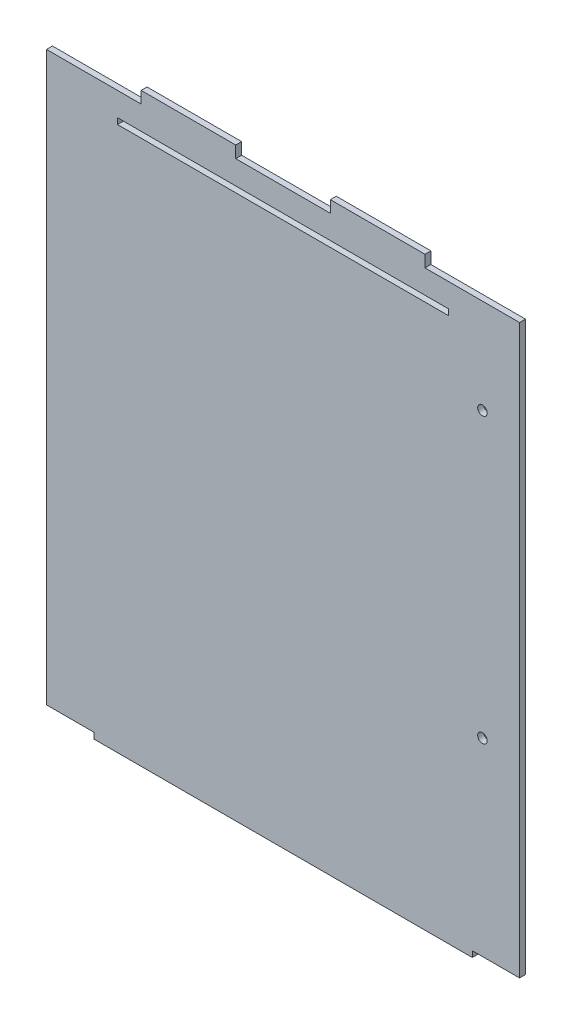
ISO-10303-21;
HEADER;
FILE_DESCRIPTION(('STEP AP214'),'2;1');
FILE_NAME('part.step','',(''),(''),'','','');
FILE_SCHEMA(('AUTOMOTIVE_DESIGN { 1 0 10303 214 1 1 1 1 }'));
ENDSEC;
DATA;
#1=APPLICATION_CONTEXT('core data for automotive mechanical design processes');
#2=APPLICATION_PROTOCOL_DEFINITION('international standard','automotive_design',2000,#1);
#3=PRODUCT_CONTEXT('',#1,'mechanical');
#4=PRODUCT('Part','Part','',(#3));
#5=PRODUCT_RELATED_PRODUCT_CATEGORY('part','',(#4));
#6=PRODUCT_DEFINITION_FORMATION('','',#4);
#7=PRODUCT_DEFINITION_CONTEXT('part definition',#1,'design');
#8=PRODUCT_DEFINITION('design','',#6,#7);
#9=PRODUCT_DEFINITION_SHAPE('','',#8);
#10=(LENGTH_UNIT() NAMED_UNIT(*) SI_UNIT(.MILLI.,.METRE.));
#11=(NAMED_UNIT(*) PLANE_ANGLE_UNIT() SI_UNIT($,.RADIAN.));
#12=(NAMED_UNIT(*) SI_UNIT($,.STERADIAN.) SOLID_ANGLE_UNIT());
#13=UNCERTAINTY_MEASURE_WITH_UNIT(LENGTH_MEASURE(1.E-05),#10,'distance_accuracy_value','');
#14=(GEOMETRIC_REPRESENTATION_CONTEXT(3) GLOBAL_UNCERTAINTY_ASSIGNED_CONTEXT((#13)) GLOBAL_UNIT_ASSIGNED_CONTEXT((#10,
#11,#12)) REPRESENTATION_CONTEXT('',''));
#15=CARTESIAN_POINT('',(0.,0.,0.));
#16=DIRECTION('',(0.,0.,1.));
#17=DIRECTION('',(1.,0.,0.));
#18=AXIS2_PLACEMENT_3D('',#15,#16,#17);
#19=CARTESIAN_POINT('',(0.,288.925,3.175));
#20=DIRECTION('',(0.,1.,0.));
#21=DIRECTION('',(-1.,0.,0.));
#22=AXIS2_PLACEMENT_3D('',#19,#20,#21);
#23=PLANE('',#22);
#24=DIRECTION('',(1.,0.,0.));
#25=VECTOR('',#24,1.);
#26=CARTESIAN_POINT('',(0.,288.925,0.));
#27=LINE('',#26,#25);
#28=CARTESIAN_POINT('',(38.1,288.925,0.));
#29=VERTEX_POINT('',#28);
#30=CARTESIAN_POINT('',(215.9,288.925,0.));
#31=VERTEX_POINT('',#30);
#32=EDGE_CURVE('E249',#29,#31,#27,.T.);
#33=ORIENTED_EDGE('',*,*,#32,.T.);
#34=DIRECTION('',(0.,0.,-1.));
#35=VECTOR('',#34,1.);
#36=CARTESIAN_POINT('',(215.9,288.925,3.175));
#37=LINE('',#36,#35);
#38=CARTESIAN_POINT('',(215.9,288.925,3.175));
#39=VERTEX_POINT('',#38);
#40=EDGE_CURVE('E11',#39,#31,#37,.T.);
#41=ORIENTED_EDGE('',*,*,#40,.F.);
#42=DIRECTION('',(1.,0.,0.));
#43=VECTOR('',#42,1.);
#44=CARTESIAN_POINT('',(0.,288.925,3.175));
#45=LINE('',#44,#43);
#46=CARTESIAN_POINT('',(38.1,288.925,3.175));
#47=VERTEX_POINT('',#46);
#48=EDGE_CURVE('E187',#47,#39,#45,.T.);
#49=ORIENTED_EDGE('',*,*,#48,.F.);
#50=DIRECTION('',(0.,0.,-1.));
#51=VECTOR('',#50,1.);
#52=CARTESIAN_POINT('',(38.1,288.925,3.175));
#53=LINE('',#52,#51);
#54=EDGE_CURVE('E54',#47,#29,#53,.T.);
#55=ORIENTED_EDGE('',*,*,#54,.T.);
#56=EDGE_LOOP('',(#33,#41,#49,#55));
#57=FACE_BOUND('',#56,.T.);
#58=ADVANCED_FACE('F35',(#57),#23,.F.);
#59=CARTESIAN_POINT('',(215.9,0.,3.175));
#60=DIRECTION('',(1.,0.,0.));
#61=DIRECTION('',(0.,0.,-1.));
#62=AXIS2_PLACEMENT_3D('',#59,#60,#61);
#63=PLANE('',#62);
#64=DIRECTION('',(0.,-1.,0.));
#65=VECTOR('',#64,1.);
#66=CARTESIAN_POINT('',(215.9,0.,0.));
#67=LINE('',#66,#65);
#68=CARTESIAN_POINT('',(215.9,285.75,0.));
#69=VERTEX_POINT('',#68);
#70=EDGE_CURVE('E193',#31,#69,#67,.T.);
#71=ORIENTED_EDGE('',*,*,#70,.T.);
#72=DIRECTION('',(0.,0.,-1.));
#73=VECTOR('',#72,1.);
#74=CARTESIAN_POINT('',(215.9,285.75,3.175));
#75=LINE('',#74,#73);
#76=CARTESIAN_POINT('',(215.9,285.75,3.175));
#77=VERTEX_POINT('',#76);
#78=EDGE_CURVE('E45',#77,#69,#75,.T.);
#79=ORIENTED_EDGE('',*,*,#78,.F.);
#80=DIRECTION('',(0.,-1.,0.));
#81=VECTOR('',#80,1.);
#82=CARTESIAN_POINT('',(215.9,0.,3.175));
#83=LINE('',#82,#81);
#84=EDGE_CURVE('E181',#39,#77,#83,.T.);
#85=ORIENTED_EDGE('',*,*,#84,.F.);
#86=ORIENTED_EDGE('',*,*,#40,.T.);
#87=EDGE_LOOP('',(#71,#79,#85,#86));
#88=FACE_BOUND('',#87,.T.);
#89=ADVANCED_FACE('F192',(#88),#63,.F.);
#90=CARTESIAN_POINT('',(0.,285.75,3.175));
#91=DIRECTION('',(0.,1.,0.));
#92=DIRECTION('',(0.,0.,1.));
#93=AXIS2_PLACEMENT_3D('',#90,#91,#92);
#94=PLANE('',#93);
#95=DIRECTION('',(1.,0.,0.));
#96=VECTOR('',#95,1.);
#97=CARTESIAN_POINT('',(0.,285.75,0.));
#98=LINE('',#97,#96);
#99=CARTESIAN_POINT('',(38.1,285.75,0.));
#100=VERTEX_POINT('',#99);
#101=EDGE_CURVE('E252',#100,#69,#98,.T.);
#102=ORIENTED_EDGE('',*,*,#101,.F.);
#103=DIRECTION('',(0.,0.,-1.));
#104=VECTOR('',#103,1.);
#105=CARTESIAN_POINT('',(38.1,285.75,3.175));
#106=LINE('',#105,#104);
#107=CARTESIAN_POINT('',(38.1,285.75,3.175));
#108=VERTEX_POINT('',#107);
#109=EDGE_CURVE('E116',#108,#100,#106,.T.);
#110=ORIENTED_EDGE('',*,*,#109,.F.);
#111=DIRECTION('',(1.,0.,0.));
#112=VECTOR('',#111,1.);
#113=CARTESIAN_POINT('',(0.,285.75,3.175));
#114=LINE('',#113,#112);
#115=EDGE_CURVE('E186',#108,#77,#114,.T.);
#116=ORIENTED_EDGE('',*,*,#115,.T.);
#117=ORIENTED_EDGE('',*,*,#78,.T.);
#118=EDGE_LOOP('',(#102,#110,#116,#117));
#119=FACE_BOUND('',#118,.T.);
#120=ADVANCED_FACE('F197',(#119),#94,.T.);
#121=CARTESIAN_POINT('',(228.6,0.,3.175));
#122=DIRECTION('',(-1.,0.,0.));
#123=DIRECTION('',(0.,0.,1.));
#124=AXIS2_PLACEMENT_3D('',#121,#122,#123);
#125=PLANE('',#124);
#126=DIRECTION('',(0.,1.,0.));
#127=VECTOR('',#126,1.);
#128=CARTESIAN_POINT('',(228.6,0.,0.));
#129=LINE('',#128,#127);
#130=CARTESIAN_POINT('',(228.6,-6.34999999999996,0.));
#131=VERTEX_POINT('',#130);
#132=CARTESIAN_POINT('',(228.6,-3.17499999999996,0.));
#133=VERTEX_POINT('',#132);
#134=EDGE_CURVE('E204',#131,#133,#129,.T.);
#135=ORIENTED_EDGE('',*,*,#134,.T.);
#136=DIRECTION('',(0.,0.,-1.));
#137=VECTOR('',#136,1.);
#138=CARTESIAN_POINT('',(228.6,-3.17499999999996,3.175));
#139=LINE('',#138,#137);
#140=CARTESIAN_POINT('',(228.6,-3.17499999999996,3.175));
#141=VERTEX_POINT('',#140);
#142=EDGE_CURVE('E39',#141,#133,#139,.T.);
#143=ORIENTED_EDGE('',*,*,#142,.F.);
#144=DIRECTION('',(0.,1.,0.));
#145=VECTOR('',#144,1.);
#146=CARTESIAN_POINT('',(228.6,0.,3.175));
#147=LINE('',#146,#145);
#148=CARTESIAN_POINT('',(228.6,-6.34999999999996,3.175));
#149=VERTEX_POINT('',#148);
#150=EDGE_CURVE('E257',#149,#141,#147,.T.);
#151=ORIENTED_EDGE('',*,*,#150,.F.);
#152=DIRECTION('',(0.,0.,-1.));
#153=VECTOR('',#152,1.);
#154=CARTESIAN_POINT('',(228.6,-6.34999999999996,3.175));
#155=LINE('',#154,#153);
#156=EDGE_CURVE('E200',#149,#131,#155,.T.);
#157=ORIENTED_EDGE('',*,*,#156,.T.);
#158=EDGE_LOOP('',(#135,#143,#151,#157));
#159=FACE_BOUND('',#158,.T.);
#160=ADVANCED_FACE('F37',(#159),#125,.F.);
#161=CARTESIAN_POINT('',(0.,-3.17499999999997,3.175));
#162=DIRECTION('',(0.,1.,0.));
#163=DIRECTION('',(-1.,0.,0.));
#164=AXIS2_PLACEMENT_3D('',#161,#162,#163);
#165=PLANE('',#164);
#166=DIRECTION('',(1.,0.,0.));
#167=VECTOR('',#166,1.);
#168=CARTESIAN_POINT('',(0.,-3.17499999999997,0.));
#169=LINE('',#168,#167);
#170=CARTESIAN_POINT('',(254.,-3.17499999999995,0.));
#171=VERTEX_POINT('',#170);
#172=EDGE_CURVE('E207',#133,#171,#169,.T.);
#173=ORIENTED_EDGE('',*,*,#172,.T.);
#174=DIRECTION('',(0.,0.,-1.));
#175=VECTOR('',#174,1.);
#176=CARTESIAN_POINT('',(254.,-3.17499999999995,3.175));
#177=LINE('',#176,#175);
#178=CARTESIAN_POINT('',(254.,-3.17499999999995,3.175));
#179=VERTEX_POINT('',#178);
#180=EDGE_CURVE('E289',#179,#171,#177,.T.);
#181=ORIENTED_EDGE('',*,*,#180,.F.);
#182=DIRECTION('',(1.,0.,0.));
#183=VECTOR('',#182,1.);
#184=CARTESIAN_POINT('',(0.,-3.17499999999997,3.175));
#185=LINE('',#184,#183);
#186=EDGE_CURVE('E129',#141,#179,#185,.T.);
#187=ORIENTED_EDGE('',*,*,#186,.F.);
#188=ORIENTED_EDGE('',*,*,#142,.T.);
#189=EDGE_LOOP('',(#173,#181,#187,#188));
#190=FACE_BOUND('',#189,.T.);
#191=ADVANCED_FACE('F295',(#190),#165,.F.);
#192=CARTESIAN_POINT('',(254.,0.,3.175));
#193=DIRECTION('',(-1.,0.,0.));
#194=DIRECTION('',(0.,0.,1.));
#195=AXIS2_PLACEMENT_3D('',#192,#193,#194);
#196=PLANE('',#195);
#197=DIRECTION('',(0.,1.,0.));
#198=VECTOR('',#197,1.);
#199=CARTESIAN_POINT('',(254.,0.,0.));
#200=LINE('',#199,#198);
#201=CARTESIAN_POINT('',(254.,301.625,0.));
#202=VERTEX_POINT('',#201);
#203=EDGE_CURVE('E210',#171,#202,#200,.T.);
#204=ORIENTED_EDGE('',*,*,#203,.T.);
#205=DIRECTION('',(0.,0.,-1.));
#206=VECTOR('',#205,1.);
#207=CARTESIAN_POINT('',(254.,301.625,3.175));
#208=LINE('',#207,#206);
#209=CARTESIAN_POINT('',(254.,301.625,3.175));
#210=VERTEX_POINT('',#209);
#211=EDGE_CURVE('E288',#210,#202,#208,.T.);
#212=ORIENTED_EDGE('',*,*,#211,.F.);
#213=DIRECTION('',(0.,1.,0.));
#214=VECTOR('',#213,1.);
#215=CARTESIAN_POINT('',(254.,0.,3.175));
#216=LINE('',#215,#214);
#217=EDGE_CURVE('E309',#179,#210,#216,.T.);
#218=ORIENTED_EDGE('',*,*,#217,.F.);
#219=ORIENTED_EDGE('',*,*,#180,.T.);
#220=EDGE_LOOP('',(#204,#212,#218,#219));
#221=FACE_BOUND('',#220,.T.);
#222=ADVANCED_FACE('F307',(#221),#196,.F.);
#223=CARTESIAN_POINT('',(0.,301.625,3.175));
#224=DIRECTION('',(0.,1.,0.));
#225=DIRECTION('',(0.,0.,1.));
#226=AXIS2_PLACEMENT_3D('',#223,#224,#225);
#227=PLANE('',#226);
#228=DIRECTION('',(1.,0.,0.));
#229=VECTOR('',#228,1.);
#230=CARTESIAN_POINT('',(0.,301.625,0.));
#231=LINE('',#230,#229);
#232=CARTESIAN_POINT('',(203.2,301.625,0.));
#233=VERTEX_POINT('',#232);
#234=EDGE_CURVE('E213',#233,#202,#231,.T.);
#235=ORIENTED_EDGE('',*,*,#234,.F.);
#236=DIRECTION('',(0.,0.,-1.));
#237=VECTOR('',#236,1.);
#238=CARTESIAN_POINT('',(203.2,301.625,3.175));
#239=LINE('',#238,#237);
#240=CARTESIAN_POINT('',(203.2,301.625,3.175));
#241=VERTEX_POINT('',#240);
#242=EDGE_CURVE('E286',#241,#233,#239,.T.);
#243=ORIENTED_EDGE('',*,*,#242,.F.);
#244=DIRECTION('',(1.,0.,0.));
#245=VECTOR('',#244,1.);
#246=CARTESIAN_POINT('',(0.,301.625,3.175));
#247=LINE('',#246,#245);
#248=EDGE_CURVE('E312',#241,#210,#247,.T.);
#249=ORIENTED_EDGE('',*,*,#248,.T.);
#250=ORIENTED_EDGE('',*,*,#211,.T.);
#251=EDGE_LOOP('',(#235,#243,#249,#250));
#252=FACE_BOUND('',#251,.T.);
#253=ADVANCED_FACE('F313',(#252),#227,.T.);
#254=CARTESIAN_POINT('',(203.2,0.,3.175));
#255=DIRECTION('',(1.,0.,0.));
#256=DIRECTION('',(0.,0.,-1.));
#257=AXIS2_PLACEMENT_3D('',#254,#255,#256);
#258=PLANE('',#257);
#259=DIRECTION('',(0.,-1.,0.));
#260=VECTOR('',#259,1.);
#261=CARTESIAN_POINT('',(203.2,0.,0.));
#262=LINE('',#261,#260);
#263=CARTESIAN_POINT('',(203.2,307.975,0.));
#264=VERTEX_POINT('',#263);
#265=EDGE_CURVE('E216',#264,#233,#262,.T.);
#266=ORIENTED_EDGE('',*,*,#265,.F.);
#267=DIRECTION('',(0.,0.,-1.));
#268=VECTOR('',#267,1.);
#269=CARTESIAN_POINT('',(203.2,307.975,3.175));
#270=LINE('',#269,#268);
#271=CARTESIAN_POINT('',(203.2,307.975,3.175));
#272=VERTEX_POINT('',#271);
#273=EDGE_CURVE('E284',#272,#264,#270,.T.);
#274=ORIENTED_EDGE('',*,*,#273,.F.);
#275=DIRECTION('',(0.,-1.,0.));
#276=VECTOR('',#275,1.);
#277=CARTESIAN_POINT('',(203.2,0.,3.175));
#278=LINE('',#277,#276);
#279=EDGE_CURVE('E317',#272,#241,#278,.T.);
#280=ORIENTED_EDGE('',*,*,#279,.T.);
#281=ORIENTED_EDGE('',*,*,#242,.T.);
#282=EDGE_LOOP('',(#266,#274,#280,#281));
#283=FACE_BOUND('',#282,.T.);
#284=ADVANCED_FACE('F442',(#283),#258,.T.);
#285=CARTESIAN_POINT('',(0.,307.975,3.175));
#286=DIRECTION('',(0.,1.,0.));
#287=DIRECTION('',(0.,0.,1.));
#288=AXIS2_PLACEMENT_3D('',#285,#286,#287);
#289=PLANE('',#288);
#290=DIRECTION('',(1.,0.,0.));
#291=VECTOR('',#290,1.);
#292=CARTESIAN_POINT('',(0.,307.975,0.));
#293=LINE('',#292,#291);
#294=CARTESIAN_POINT('',(152.4,307.975,0.));
#295=VERTEX_POINT('',#294);
#296=EDGE_CURVE('E219',#295,#264,#293,.T.);
#297=ORIENTED_EDGE('',*,*,#296,.F.);
#298=DIRECTION('',(0.,0.,-1.));
#299=VECTOR('',#298,1.);
#300=CARTESIAN_POINT('',(152.4,307.975,3.175));
#301=LINE('',#300,#299);
#302=CARTESIAN_POINT('',(152.4,307.975,3.175));
#303=VERTEX_POINT('',#302);
#304=EDGE_CURVE('E282',#303,#295,#301,.T.);
#305=ORIENTED_EDGE('',*,*,#304,.F.);
#306=DIRECTION('',(1.,0.,0.));
#307=VECTOR('',#306,1.);
#308=CARTESIAN_POINT('',(0.,307.975,3.175));
#309=LINE('',#308,#307);
#310=EDGE_CURVE('E319',#303,#272,#309,.T.);
#311=ORIENTED_EDGE('',*,*,#310,.T.);
#312=ORIENTED_EDGE('',*,*,#273,.T.);
#313=EDGE_LOOP('',(#297,#305,#311,#312));
#314=FACE_BOUND('',#313,.T.);
#315=ADVANCED_FACE('F438',(#314),#289,.T.);
#316=CARTESIAN_POINT('',(152.4,0.,3.175));
#317=DIRECTION('',(-1.,0.,0.));
#318=DIRECTION('',(0.,0.,1.));
#319=AXIS2_PLACEMENT_3D('',#316,#317,#318);
#320=PLANE('',#319);
#321=DIRECTION('',(0.,1.,0.));
#322=VECTOR('',#321,1.);
#323=CARTESIAN_POINT('',(152.4,0.,0.));
#324=LINE('',#323,#322);
#325=CARTESIAN_POINT('',(152.4,301.625,0.));
#326=VERTEX_POINT('',#325);
#327=EDGE_CURVE('E222',#326,#295,#324,.T.);
#328=ORIENTED_EDGE('',*,*,#327,.F.);
#329=DIRECTION('',(0.,0.,-1.));
#330=VECTOR('',#329,1.);
#331=CARTESIAN_POINT('',(152.4,301.625,3.175));
#332=LINE('',#331,#330);
#333=CARTESIAN_POINT('',(152.4,301.625,3.175));
#334=VERTEX_POINT('',#333);
#335=EDGE_CURVE('E280',#334,#326,#332,.T.);
#336=ORIENTED_EDGE('',*,*,#335,.F.);
#337=DIRECTION('',(0.,1.,0.));
#338=VECTOR('',#337,1.);
#339=CARTESIAN_POINT('',(152.4,0.,3.175));
#340=LINE('',#339,#338);
#341=EDGE_CURVE('E326',#334,#303,#340,.T.);
#342=ORIENTED_EDGE('',*,*,#341,.T.);
#343=ORIENTED_EDGE('',*,*,#304,.T.);
#344=EDGE_LOOP('',(#328,#336,#342,#343));
#345=FACE_BOUND('',#344,.T.);
#346=ADVANCED_FACE('F434',(#345),#320,.T.);
#347=CARTESIAN_POINT('',(0.,301.625,3.175));
#348=DIRECTION('',(0.,1.,0.));
#349=DIRECTION('',(0.,0.,1.));
#350=AXIS2_PLACEMENT_3D('',#347,#348,#349);
#351=PLANE('',#350);
#352=DIRECTION('',(1.,0.,0.));
#353=VECTOR('',#352,1.);
#354=CARTESIAN_POINT('',(0.,301.625,0.));
#355=LINE('',#354,#353);
#356=CARTESIAN_POINT('',(101.6,301.625,0.));
#357=VERTEX_POINT('',#356);
#358=EDGE_CURVE('E225',#357,#326,#355,.T.);
#359=ORIENTED_EDGE('',*,*,#358,.F.);
#360=DIRECTION('',(0.,0.,-1.));
#361=VECTOR('',#360,1.);
#362=CARTESIAN_POINT('',(101.6,301.625,3.175));
#363=LINE('',#362,#361);
#364=CARTESIAN_POINT('',(101.6,301.625,3.175));
#365=VERTEX_POINT('',#364);
#366=EDGE_CURVE('E278',#365,#357,#363,.T.);
#367=ORIENTED_EDGE('',*,*,#366,.F.);
#368=DIRECTION('',(1.,0.,0.));
#369=VECTOR('',#368,1.);
#370=CARTESIAN_POINT('',(0.,301.625,3.175));
#371=LINE('',#370,#369);
#372=EDGE_CURVE('E329',#365,#334,#371,.T.);
#373=ORIENTED_EDGE('',*,*,#372,.T.);
#374=ORIENTED_EDGE('',*,*,#335,.T.);
#375=EDGE_LOOP('',(#359,#367,#373,#374));
#376=FACE_BOUND('',#375,.T.);
#377=ADVANCED_FACE('F430',(#376),#351,.T.);
#378=CARTESIAN_POINT('',(101.600000000001,2.22044604925032E-13,3.175));
#379=DIRECTION('',(1.,0.,0.));
#380=DIRECTION('',(0.,1.,0.));
#381=AXIS2_PLACEMENT_3D('',#378,#379,#380);
#382=PLANE('',#381);
#383=DIRECTION('',(0.,-1.,0.));
#384=VECTOR('',#383,1.);
#385=CARTESIAN_POINT('',(101.600000000001,2.22044604925032E-13,0.));
#386=LINE('',#385,#384);
#387=CARTESIAN_POINT('',(101.6,307.975,0.));
#388=VERTEX_POINT('',#387);
#389=EDGE_CURVE('E228',#388,#357,#386,.T.);
#390=ORIENTED_EDGE('',*,*,#389,.F.);
#391=DIRECTION('',(0.,0.,-1.));
#392=VECTOR('',#391,1.);
#393=CARTESIAN_POINT('',(101.6,307.975,3.175));
#394=LINE('',#393,#392);
#395=CARTESIAN_POINT('',(101.6,307.975,3.175));
#396=VERTEX_POINT('',#395);
#397=EDGE_CURVE('E276',#396,#388,#394,.T.);
#398=ORIENTED_EDGE('',*,*,#397,.F.);
#399=DIRECTION('',(0.,-1.,0.));
#400=VECTOR('',#399,1.);
#401=CARTESIAN_POINT('',(101.600000000001,2.22044604925032E-13,3.175));
#402=LINE('',#401,#400);
#403=EDGE_CURVE('E332',#396,#365,#402,.T.);
#404=ORIENTED_EDGE('',*,*,#403,.T.);
#405=ORIENTED_EDGE('',*,*,#366,.T.);
#406=EDGE_LOOP('',(#390,#398,#404,#405));
#407=FACE_BOUND('',#406,.T.);
#408=ADVANCED_FACE('F426',(#407),#382,.T.);
#409=CARTESIAN_POINT('',(0.,307.975,3.175));
#410=DIRECTION('',(0.,1.,0.));
#411=DIRECTION('',(0.,0.,1.));
#412=AXIS2_PLACEMENT_3D('',#409,#410,#411);
#413=PLANE('',#412);
#414=DIRECTION('',(1.,0.,0.));
#415=VECTOR('',#414,1.);
#416=CARTESIAN_POINT('',(0.,307.975,0.));
#417=LINE('',#416,#415);
#418=CARTESIAN_POINT('',(50.8,307.975,0.));
#419=VERTEX_POINT('',#418);
#420=EDGE_CURVE('E231',#419,#388,#417,.T.);
#421=ORIENTED_EDGE('',*,*,#420,.F.);
#422=DIRECTION('',(0.,0.,-1.));
#423=VECTOR('',#422,1.);
#424=CARTESIAN_POINT('',(50.8,307.975,3.175));
#425=LINE('',#424,#423);
#426=CARTESIAN_POINT('',(50.8,307.975,3.175));
#427=VERTEX_POINT('',#426);
#428=EDGE_CURVE('E274',#427,#419,#425,.T.);
#429=ORIENTED_EDGE('',*,*,#428,.F.);
#430=DIRECTION('',(1.,0.,0.));
#431=VECTOR('',#430,1.);
#432=CARTESIAN_POINT('',(0.,307.975,3.175));
#433=LINE('',#432,#431);
#434=EDGE_CURVE('E335',#427,#396,#433,.T.);
#435=ORIENTED_EDGE('',*,*,#434,.T.);
#436=ORIENTED_EDGE('',*,*,#397,.T.);
#437=EDGE_LOOP('',(#421,#429,#435,#436));
#438=FACE_BOUND('',#437,.T.);
#439=ADVANCED_FACE('F422',(#438),#413,.T.);
#440=CARTESIAN_POINT('',(50.8,0.,3.175));
#441=DIRECTION('',(-1.,0.,0.));
#442=DIRECTION('',(0.,0.,1.));
#443=AXIS2_PLACEMENT_3D('',#440,#441,#442);
#444=PLANE('',#443);
#445=DIRECTION('',(0.,1.,0.));
#446=VECTOR('',#445,1.);
#447=CARTESIAN_POINT('',(50.8,0.,0.));
#448=LINE('',#447,#446);
#449=CARTESIAN_POINT('',(50.8,301.625,0.));
#450=VERTEX_POINT('',#449);
#451=EDGE_CURVE('E234',#450,#419,#448,.T.);
#452=ORIENTED_EDGE('',*,*,#451,.F.);
#453=DIRECTION('',(0.,0.,-1.));
#454=VECTOR('',#453,1.);
#455=CARTESIAN_POINT('',(50.8,301.625,3.175));
#456=LINE('',#455,#454);
#457=CARTESIAN_POINT('',(50.8,301.625,3.175));
#458=VERTEX_POINT('',#457);
#459=EDGE_CURVE('E272',#458,#450,#456,.T.);
#460=ORIENTED_EDGE('',*,*,#459,.F.);
#461=DIRECTION('',(0.,1.,0.));
#462=VECTOR('',#461,1.);
#463=CARTESIAN_POINT('',(50.8,0.,3.175));
#464=LINE('',#463,#462);
#465=EDGE_CURVE('E338',#458,#427,#464,.T.);
#466=ORIENTED_EDGE('',*,*,#465,.T.);
#467=ORIENTED_EDGE('',*,*,#428,.T.);
#468=EDGE_LOOP('',(#452,#460,#466,#467));
#469=FACE_BOUND('',#468,.T.);
#470=ADVANCED_FACE('F418',(#469),#444,.T.);
#471=CARTESIAN_POINT('',(0.,301.625,3.175));
#472=DIRECTION('',(0.,1.,0.));
#473=DIRECTION('',(0.,0.,1.));
#474=AXIS2_PLACEMENT_3D('',#471,#472,#473);
#475=PLANE('',#474);
#476=DIRECTION('',(1.,0.,0.));
#477=VECTOR('',#476,1.);
#478=CARTESIAN_POINT('',(0.,301.625,0.));
#479=LINE('',#478,#477);
#480=CARTESIAN_POINT('',(0.,301.625,0.));
#481=VERTEX_POINT('',#480);
#482=EDGE_CURVE('E237',#481,#450,#479,.T.);
#483=ORIENTED_EDGE('',*,*,#482,.F.);
#484=DIRECTION('',(0.,0.,-1.));
#485=VECTOR('',#484,1.);
#486=CARTESIAN_POINT('',(0.,301.625,3.175));
#487=LINE('',#486,#485);
#488=CARTESIAN_POINT('',(0.,301.625,3.175));
#489=VERTEX_POINT('',#488);
#490=EDGE_CURVE('E270',#489,#481,#487,.T.);
#491=ORIENTED_EDGE('',*,*,#490,.F.);
#492=DIRECTION('',(1.,0.,0.));
#493=VECTOR('',#492,1.);
#494=CARTESIAN_POINT('',(0.,301.625,3.175));
#495=LINE('',#494,#493);
#496=EDGE_CURVE('E341',#489,#458,#495,.T.);
#497=ORIENTED_EDGE('',*,*,#496,.T.);
#498=ORIENTED_EDGE('',*,*,#459,.T.);
#499=EDGE_LOOP('',(#483,#491,#497,#498));
#500=FACE_BOUND('',#499,.T.);
#501=ADVANCED_FACE('F414',(#500),#475,.T.);
#502=CARTESIAN_POINT('',(0.,0.,3.175));
#503=DIRECTION('',(-1.,0.,0.));
#504=DIRECTION('',(0.,-1.,0.));
#505=AXIS2_PLACEMENT_3D('',#502,#503,#504);
#506=PLANE('',#505);
#507=DIRECTION('',(0.,1.,0.));
#508=VECTOR('',#507,1.);
#509=CARTESIAN_POINT('',(0.,0.,0.));
#510=LINE('',#509,#508);
#511=CARTESIAN_POINT('',(0.,-3.17499999999997,0.));
#512=VERTEX_POINT('',#511);
#513=EDGE_CURVE('E240',#512,#481,#510,.T.);
#514=ORIENTED_EDGE('',*,*,#513,.F.);
#515=DIRECTION('',(0.,0.,-1.));
#516=VECTOR('',#515,1.);
#517=CARTESIAN_POINT('',(0.,-3.17499999999997,3.175));
#518=LINE('',#517,#516);
#519=CARTESIAN_POINT('',(0.,-3.17499999999997,3.175));
#520=VERTEX_POINT('',#519);
#521=EDGE_CURVE('E268',#520,#512,#518,.T.);
#522=ORIENTED_EDGE('',*,*,#521,.F.);
#523=DIRECTION('',(0.,1.,0.));
#524=VECTOR('',#523,1.);
#525=CARTESIAN_POINT('',(0.,0.,3.175));
#526=LINE('',#525,#524);
#527=EDGE_CURVE('E344',#520,#489,#526,.T.);
#528=ORIENTED_EDGE('',*,*,#527,.T.);
#529=ORIENTED_EDGE('',*,*,#490,.T.);
#530=EDGE_LOOP('',(#514,#522,#528,#529));
#531=FACE_BOUND('',#530,.T.);
#532=ADVANCED_FACE('F410',(#531),#506,.T.);
#533=CARTESIAN_POINT('',(0.,-3.17499999999997,3.175));
#534=DIRECTION('',(0.,1.,0.));
#535=DIRECTION('',(-1.,0.,0.));
#536=AXIS2_PLACEMENT_3D('',#533,#534,#535);
#537=PLANE('',#536);
#538=DIRECTION('',(1.,0.,0.));
#539=VECTOR('',#538,1.);
#540=CARTESIAN_POINT('',(0.,-3.17499999999997,0.));
#541=LINE('',#540,#539);
#542=CARTESIAN_POINT('',(25.4,-3.17499999999997,0.));
#543=VERTEX_POINT('',#542);
#544=EDGE_CURVE('E243',#512,#543,#541,.T.);
#545=ORIENTED_EDGE('',*,*,#544,.T.);
#546=DIRECTION('',(0.,0.,-1.));
#547=VECTOR('',#546,1.);
#548=CARTESIAN_POINT('',(25.4,-3.17499999999997,3.175));
#549=LINE('',#548,#547);
#550=CARTESIAN_POINT('',(25.4,-3.17499999999997,3.175));
#551=VERTEX_POINT('',#550);
#552=EDGE_CURVE('E265',#551,#543,#549,.T.);
#553=ORIENTED_EDGE('',*,*,#552,.F.);
#554=DIRECTION('',(1.,0.,0.));
#555=VECTOR('',#554,1.);
#556=CARTESIAN_POINT('',(0.,-3.17499999999997,3.175));
#557=LINE('',#556,#555);
#558=EDGE_CURVE('E347',#520,#551,#557,.T.);
#559=ORIENTED_EDGE('',*,*,#558,.F.);
#560=ORIENTED_EDGE('',*,*,#521,.T.);
#561=EDGE_LOOP('',(#545,#553,#559,#560));
#562=FACE_BOUND('',#561,.T.);
#563=ADVANCED_FACE('F406',(#562),#537,.F.);
#564=CARTESIAN_POINT('',(25.4,0.,3.175));
#565=DIRECTION('',(1.,0.,0.));
#566=DIRECTION('',(0.,1.,0.));
#567=AXIS2_PLACEMENT_3D('',#564,#565,#566);
#568=PLANE('',#567);
#569=DIRECTION('',(0.,-1.,0.));
#570=VECTOR('',#569,1.);
#571=CARTESIAN_POINT('',(25.4,0.,0.));
#572=LINE('',#571,#570);
#573=CARTESIAN_POINT('',(25.4,-6.34999999999997,0.));
#574=VERTEX_POINT('',#573);
#575=EDGE_CURVE('E245',#543,#574,#572,.T.);
#576=ORIENTED_EDGE('',*,*,#575,.T.);
#577=DIRECTION('',(0.,0.,-1.));
#578=VECTOR('',#577,1.);
#579=CARTESIAN_POINT('',(25.4,-6.34999999999997,3.175));
#580=LINE('',#579,#578);
#581=CARTESIAN_POINT('',(25.4,-6.34999999999997,3.175));
#582=VERTEX_POINT('',#581);
#583=EDGE_CURVE('E262',#582,#574,#580,.T.);
#584=ORIENTED_EDGE('',*,*,#583,.F.);
#585=DIRECTION('',(0.,-1.,0.));
#586=VECTOR('',#585,1.);
#587=CARTESIAN_POINT('',(25.4,0.,3.175));
#588=LINE('',#587,#586);
#589=EDGE_CURVE('E349',#551,#582,#588,.T.);
#590=ORIENTED_EDGE('',*,*,#589,.F.);
#591=ORIENTED_EDGE('',*,*,#552,.T.);
#592=EDGE_LOOP('',(#576,#584,#590,#591));
#593=FACE_BOUND('',#592,.T.);
#594=ADVANCED_FACE('F403',(#593),#568,.F.);
#595=CARTESIAN_POINT('',(0.,-6.34999999999997,3.175));
#596=DIRECTION('',(0.,1.,0.));
#597=DIRECTION('',(-1.,0.,0.));
#598=AXIS2_PLACEMENT_3D('',#595,#596,#597);
#599=PLANE('',#598);
#600=DIRECTION('',(1.,0.,0.));
#601=VECTOR('',#600,1.);
#602=CARTESIAN_POINT('',(0.,-6.34999999999997,0.));
#603=LINE('',#602,#601);
#604=EDGE_CURVE('E247',#574,#131,#603,.T.);
#605=ORIENTED_EDGE('',*,*,#604,.T.);
#606=ORIENTED_EDGE('',*,*,#156,.F.);
#607=DIRECTION('',(1.,0.,0.));
#608=VECTOR('',#607,1.);
#609=CARTESIAN_POINT('',(0.,-6.34999999999997,3.175));
#610=LINE('',#609,#608);
#611=EDGE_CURVE('E351',#582,#149,#610,.T.);
#612=ORIENTED_EDGE('',*,*,#611,.F.);
#613=ORIENTED_EDGE('',*,*,#583,.T.);
#614=EDGE_LOOP('',(#605,#606,#612,#613));
#615=FACE_BOUND('',#614,.T.);
#616=ADVANCED_FACE('F356',(#615),#599,.F.);
#617=CARTESIAN_POINT('',(38.1,0.,3.175));
#618=DIRECTION('',(1.,0.,0.));
#619=DIRECTION('',(0.,0.,-1.));
#620=AXIS2_PLACEMENT_3D('',#617,#618,#619);
#621=PLANE('',#620);
#622=DIRECTION('',(0.,-1.,0.));
#623=VECTOR('',#622,1.);
#624=CARTESIAN_POINT('',(38.1,0.,0.));
#625=LINE('',#624,#623);
#626=EDGE_CURVE('E254',#29,#100,#625,.T.);
#627=ORIENTED_EDGE('',*,*,#626,.F.);
#628=ORIENTED_EDGE('',*,*,#54,.F.);
#629=DIRECTION('',(0.,-1.,0.));
#630=VECTOR('',#629,1.);
#631=CARTESIAN_POINT('',(38.1,0.,3.175));
#632=LINE('',#631,#630);
#633=EDGE_CURVE('E198',#47,#108,#632,.T.);
#634=ORIENTED_EDGE('',*,*,#633,.T.);
#635=ORIENTED_EDGE('',*,*,#109,.T.);
#636=EDGE_LOOP('',(#627,#628,#634,#635));
#637=FACE_BOUND('',#636,.T.);
#638=ADVANCED_FACE('F402',(#637),#621,.T.);
#639=CARTESIAN_POINT('',(0.,0.,3.175));
#640=DIRECTION('',(0.,0.,1.));
#641=DIRECTION('',(1.,0.,0.));
#642=AXIS2_PLACEMENT_3D('',#639,#640,#641);
#643=PLANE('',#642);
#644=CARTESIAN_POINT('',(234.063292103428,250.825,3.175));
#645=DIRECTION('',(0.,0.,-1.));
#646=DIRECTION('',(-1.,0.,0.));
#647=AXIS2_PLACEMENT_3D('',#644,#645,#646);
#648=CIRCLE('',#647,2.53999999999998);
#649=CARTESIAN_POINT('',(231.523292103428,250.825,3.175));
#650=VERTEX_POINT('',#649);
#651=EDGE_CURVE('E208',#650,#650,#648,.T.);
#652=ORIENTED_EDGE('',*,*,#651,.T.);
#653=EDGE_LOOP('',(#652));
#654=FACE_BOUND('',#653,.T.);
#655=CARTESIAN_POINT('',(234.063292103428,98.425,3.175));
#656=DIRECTION('',(0.,0.,-1.));
#657=DIRECTION('',(-1.,0.,0.));
#658=AXIS2_PLACEMENT_3D('',#655,#656,#657);
#659=CIRCLE('',#658,2.53999999999998);
#660=CARTESIAN_POINT('',(231.523292103428,98.425,3.175));
#661=VERTEX_POINT('',#660);
#662=EDGE_CURVE('E362',#661,#661,#659,.T.);
#663=ORIENTED_EDGE('',*,*,#662,.T.);
#664=EDGE_LOOP('',(#663));
#665=FACE_BOUND('',#664,.T.);
#666=ORIENTED_EDGE('',*,*,#150,.T.);
#667=ORIENTED_EDGE('',*,*,#186,.T.);
#668=ORIENTED_EDGE('',*,*,#217,.T.);
#669=ORIENTED_EDGE('',*,*,#248,.F.);
#670=ORIENTED_EDGE('',*,*,#279,.F.);
#671=ORIENTED_EDGE('',*,*,#310,.F.);
#672=ORIENTED_EDGE('',*,*,#341,.F.);
#673=ORIENTED_EDGE('',*,*,#372,.F.);
#674=ORIENTED_EDGE('',*,*,#403,.F.);
#675=ORIENTED_EDGE('',*,*,#434,.F.);
#676=ORIENTED_EDGE('',*,*,#465,.F.);
#677=ORIENTED_EDGE('',*,*,#496,.F.);
#678=ORIENTED_EDGE('',*,*,#527,.F.);
#679=ORIENTED_EDGE('',*,*,#558,.T.);
#680=ORIENTED_EDGE('',*,*,#589,.T.);
#681=ORIENTED_EDGE('',*,*,#611,.T.);
#682=EDGE_LOOP('',(#666,#667,#668,#669,#670,#671,#672,#673,#674,#675,#676,#677,#678,#679,#680,#681));
#683=FACE_BOUND('',#682,.T.);
#684=ORIENTED_EDGE('',*,*,#48,.T.);
#685=ORIENTED_EDGE('',*,*,#84,.T.);
#686=ORIENTED_EDGE('',*,*,#115,.F.);
#687=ORIENTED_EDGE('',*,*,#633,.F.);
#688=EDGE_LOOP('',(#684,#685,#686,#687));
#689=FACE_BOUND('',#688,.T.);
#690=ADVANCED_FACE('F183',(#654,#665,#683,#689),#643,.T.);
#691=CARTESIAN_POINT('',(0.,0.,0.));
#692=DIRECTION('',(0.,0.,1.));
#693=DIRECTION('',(1.,0.,0.));
#694=AXIS2_PLACEMENT_3D('',#691,#692,#693);
#695=PLANE('',#694);
#696=CARTESIAN_POINT('',(234.063292103428,250.825,0.));
#697=DIRECTION('',(0.,0.,-1.));
#698=DIRECTION('',(-1.,0.,0.));
#699=AXIS2_PLACEMENT_3D('',#696,#697,#698);
#700=CIRCLE('',#699,2.53999999999998);
#701=CARTESIAN_POINT('',(231.523292103428,250.825,0.));
#702=VERTEX_POINT('',#701);
#703=EDGE_CURVE('E365',#702,#702,#700,.T.);
#704=ORIENTED_EDGE('',*,*,#703,.F.);
#705=EDGE_LOOP('',(#704));
#706=FACE_BOUND('',#705,.T.);
#707=CARTESIAN_POINT('',(234.063292103428,98.425,0.));
#708=DIRECTION('',(0.,0.,-1.));
#709=DIRECTION('',(-1.,0.,0.));
#710=AXIS2_PLACEMENT_3D('',#707,#708,#709);
#711=CIRCLE('',#710,2.53999999999998);
#712=CARTESIAN_POINT('',(231.523292103428,98.425,0.));
#713=VERTEX_POINT('',#712);
#714=EDGE_CURVE('E359',#713,#713,#711,.T.);
#715=ORIENTED_EDGE('',*,*,#714,.F.);
#716=EDGE_LOOP('',(#715));
#717=FACE_BOUND('',#716,.T.);
#718=ORIENTED_EDGE('',*,*,#134,.F.);
#719=ORIENTED_EDGE('',*,*,#604,.F.);
#720=ORIENTED_EDGE('',*,*,#575,.F.);
#721=ORIENTED_EDGE('',*,*,#544,.F.);
#722=ORIENTED_EDGE('',*,*,#513,.T.);
#723=ORIENTED_EDGE('',*,*,#482,.T.);
#724=ORIENTED_EDGE('',*,*,#451,.T.);
#725=ORIENTED_EDGE('',*,*,#420,.T.);
#726=ORIENTED_EDGE('',*,*,#389,.T.);
#727=ORIENTED_EDGE('',*,*,#358,.T.);
#728=ORIENTED_EDGE('',*,*,#327,.T.);
#729=ORIENTED_EDGE('',*,*,#296,.T.);
#730=ORIENTED_EDGE('',*,*,#265,.T.);
#731=ORIENTED_EDGE('',*,*,#234,.T.);
#732=ORIENTED_EDGE('',*,*,#203,.F.);
#733=ORIENTED_EDGE('',*,*,#172,.F.);
#734=EDGE_LOOP('',(#718,#719,#720,#721,#722,#723,#724,#725,#726,#727,#728,#729,#730,#731,#732,#733));
#735=FACE_BOUND('',#734,.T.);
#736=ORIENTED_EDGE('',*,*,#32,.F.);
#737=ORIENTED_EDGE('',*,*,#626,.T.);
#738=ORIENTED_EDGE('',*,*,#101,.T.);
#739=ORIENTED_EDGE('',*,*,#70,.F.);
#740=EDGE_LOOP('',(#736,#737,#738,#739));
#741=FACE_BOUND('',#740,.T.);
#742=ADVANCED_FACE('F302',(#706,#717,#735,#741),#695,.F.);
#743=CARTESIAN_POINT('',(234.063292103428,98.425,3.175));
#744=DIRECTION('',(0.,0.,-1.));
#745=DIRECTION('',(-1.,0.,0.));
#746=AXIS2_PLACEMENT_3D('',#743,#744,#745);
#747=CYLINDRICAL_SURFACE('',#746,2.53999999999998);
#748=ORIENTED_EDGE('',*,*,#662,.F.);
#749=EDGE_LOOP('',(#748));
#750=FACE_BOUND('',#749,.T.);
#751=ORIENTED_EDGE('',*,*,#714,.T.);
#752=EDGE_LOOP('',(#751));
#753=FACE_BOUND('',#752,.T.);
#754=ADVANCED_FACE('F376',(#750,#753),#747,.F.);
#755=CARTESIAN_POINT('',(234.063292103428,250.825,3.175));
#756=DIRECTION('',(0.,0.,-1.));
#757=DIRECTION('',(-1.,0.,0.));
#758=AXIS2_PLACEMENT_3D('',#755,#756,#757);
#759=CYLINDRICAL_SURFACE('',#758,2.53999999999998);
#760=ORIENTED_EDGE('',*,*,#651,.F.);
#761=EDGE_LOOP('',(#760));
#762=FACE_BOUND('',#761,.T.);
#763=ORIENTED_EDGE('',*,*,#703,.T.);
#764=EDGE_LOOP('',(#763));
#765=FACE_BOUND('',#764,.T.);
#766=ADVANCED_FACE('F373',(#762,#765),#759,.F.);
#767=CLOSED_SHELL('',(#58,#89,#120,#160,#191,#222,#253,#284,#315,#346,#377,#408,#439,#470,#501,
#532,#563,#594,#616,#638,#690,#742,#754,#766));
#768=MANIFOLD_SOLID_BREP('B2',#767);
#769=ADVANCED_BREP_SHAPE_REPRESENTATION('',(#18,#768),#14);
#770=SHAPE_DEFINITION_REPRESENTATION(#9,#769);
ENDSEC;
END-ISO-10303-21;
